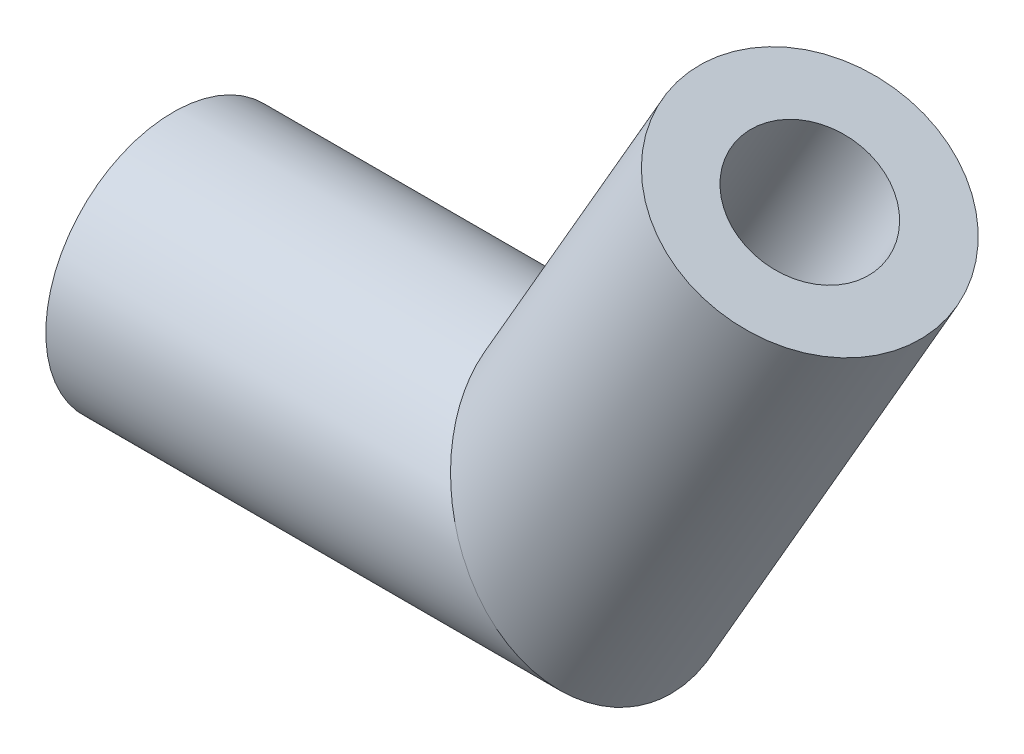
ISO-10303-21;
HEADER;
FILE_DESCRIPTION(('STEP AP214'),'2;1');
FILE_NAME('part.step','',(''),(''),'','','');
FILE_SCHEMA(('AUTOMOTIVE_DESIGN { 1 0 10303 214 1 1 1 1 }'));
ENDSEC;
DATA;
#1=APPLICATION_CONTEXT('core data for automotive mechanical design processes');
#2=APPLICATION_PROTOCOL_DEFINITION('international standard','automotive_design',2000,#1);
#3=PRODUCT_CONTEXT('',#1,'mechanical');
#4=PRODUCT('Part','Part','',(#3));
#5=PRODUCT_RELATED_PRODUCT_CATEGORY('part','',(#4));
#6=PRODUCT_DEFINITION_FORMATION('','',#4);
#7=PRODUCT_DEFINITION_CONTEXT('part definition',#1,'design');
#8=PRODUCT_DEFINITION('design','',#6,#7);
#9=PRODUCT_DEFINITION_SHAPE('','',#8);
#10=(LENGTH_UNIT() NAMED_UNIT(*) SI_UNIT(.MILLI.,.METRE.));
#11=(NAMED_UNIT(*) PLANE_ANGLE_UNIT() SI_UNIT($,.RADIAN.));
#12=(NAMED_UNIT(*) SI_UNIT($,.STERADIAN.) SOLID_ANGLE_UNIT());
#13=UNCERTAINTY_MEASURE_WITH_UNIT(LENGTH_MEASURE(1.E-05),#10,'distance_accuracy_value','');
#14=(GEOMETRIC_REPRESENTATION_CONTEXT(3) GLOBAL_UNCERTAINTY_ASSIGNED_CONTEXT((#13)) GLOBAL_UNIT_ASSIGNED_CONTEXT((#10,
#11,#12)) REPRESENTATION_CONTEXT('',''));
#15=CARTESIAN_POINT('',(0.,0.,0.));
#16=DIRECTION('',(0.,0.,1.));
#17=DIRECTION('',(1.,0.,0.));
#18=AXIS2_PLACEMENT_3D('',#15,#16,#17);
#19=CARTESIAN_POINT('',(8.04474411167424,-3.38660254037846,0.));
#20=DIRECTION('',(0.499999999999998,0.86602540378444,0.));
#21=DIRECTION('',(-0.86602540378444,0.499999999999998,0.));
#22=AXIS2_PLACEMENT_3D('',#19,#20,#21);
#23=CYLINDRICAL_SURFACE('',#22,3.);
#24=CARTESIAN_POINT('',(10.,0.,0.));
#25=DIRECTION('',(0.866025403784438,0.500000000000001,0.));
#26=DIRECTION('',(0.500000000000001,-0.866025403784438,0.));
#27=AXIS2_PLACEMENT_3D('',#24,#25,#26);
#28=ELLIPSE('',#27,3.46410161513776,3.);
#29=CARTESIAN_POINT('',(11.7320508075689,-3.,0.));
#30=VERTEX_POINT('',#29);
#31=EDGE_CURVE('E46',#30,#30,#28,.F.);
#32=ORIENTED_EDGE('',*,*,#31,.F.);
#33=EDGE_LOOP('',(#32));
#34=FACE_BOUND('',#33,.T.);
#35=CARTESIAN_POINT('',(15.,8.6602540378444,0.));
#36=DIRECTION('',(0.499999999999998,0.86602540378444,0.));
#37=DIRECTION('',(0.,0.,-1.));
#38=AXIS2_PLACEMENT_3D('',#35,#36,#37);
#39=CIRCLE('',#38,3.);
#40=CARTESIAN_POINT('',(15.,8.6602540378444,-3.));
#41=VERTEX_POINT('',#40);
#42=EDGE_CURVE('E66',#41,#41,#39,.T.);
#43=ORIENTED_EDGE('',*,*,#42,.F.);
#44=EDGE_LOOP('',(#43));
#45=FACE_BOUND('',#44,.T.);
#46=ADVANCED_FACE('F43',(#34,#45),#23,.T.);
#47=CARTESIAN_POINT('',(0.,0.,0.));
#48=DIRECTION('',(1.,0.,0.));
#49=DIRECTION('',(0.,0.,-1.));
#50=AXIS2_PLACEMENT_3D('',#47,#48,#49);
#51=CYLINDRICAL_SURFACE('',#50,3.);
#52=CARTESIAN_POINT('',(0.,0.,0.));
#53=DIRECTION('',(1.,0.,0.));
#54=DIRECTION('',(0.,0.,-1.));
#55=AXIS2_PLACEMENT_3D('',#52,#53,#54);
#56=CIRCLE('',#55,3.);
#57=CARTESIAN_POINT('',(0.,0.,-3.));
#58=VERTEX_POINT('',#57);
#59=EDGE_CURVE('E63',#58,#58,#56,.T.);
#60=ORIENTED_EDGE('',*,*,#59,.T.);
#61=EDGE_LOOP('',(#60));
#62=FACE_BOUND('',#61,.T.);
#63=ORIENTED_EDGE('',*,*,#31,.T.);
#64=EDGE_LOOP('',(#63));
#65=FACE_BOUND('',#64,.T.);
#66=ADVANCED_FACE('F75',(#62,#65),#51,.T.);
#67=CARTESIAN_POINT('',(15.,8.6602540378444,0.));
#68=DIRECTION('',(0.499999999999998,0.86602540378444,0.));
#69=DIRECTION('',(0.,0.,-1.));
#70=AXIS2_PLACEMENT_3D('',#67,#68,#69);
#71=PLANE('',#70);
#72=CARTESIAN_POINT('',(15.,8.6602540378444,0.));
#73=DIRECTION('',(0.499999999999998,0.86602540378444,0.));
#74=DIRECTION('',(0.,0.,-1.));
#75=AXIS2_PLACEMENT_3D('',#72,#73,#74);
#76=CIRCLE('',#75,1.6);
#77=CARTESIAN_POINT('',(15.,8.6602540378444,-1.6));
#78=VERTEX_POINT('',#77);
#79=EDGE_CURVE('E57',#78,#78,#76,.F.);
#80=ORIENTED_EDGE('',*,*,#79,.T.);
#81=EDGE_LOOP('',(#80));
#82=FACE_BOUND('',#81,.T.);
#83=ORIENTED_EDGE('',*,*,#42,.T.);
#84=EDGE_LOOP('',(#83));
#85=FACE_BOUND('',#84,.T.);
#86=ADVANCED_FACE('F82',(#82,#85),#71,.T.);
#87=CARTESIAN_POINT('',(0.,0.,0.));
#88=DIRECTION('',(1.,0.,0.));
#89=DIRECTION('',(0.,0.,-1.));
#90=AXIS2_PLACEMENT_3D('',#87,#88,#89);
#91=PLANE('',#90);
#92=CARTESIAN_POINT('',(0.,0.,0.));
#93=DIRECTION('',(1.,0.,0.));
#94=DIRECTION('',(0.,0.,-1.));
#95=AXIS2_PLACEMENT_3D('',#92,#93,#94);
#96=CIRCLE('',#95,1.6);
#97=CARTESIAN_POINT('',(0.,0.,-1.6));
#98=VERTEX_POINT('',#97);
#99=EDGE_CURVE('E51',#98,#98,#96,.F.);
#100=ORIENTED_EDGE('',*,*,#99,.F.);
#101=EDGE_LOOP('',(#100));
#102=FACE_BOUND('',#101,.T.);
#103=ORIENTED_EDGE('',*,*,#59,.F.);
#104=EDGE_LOOP('',(#103));
#105=FACE_BOUND('',#104,.T.);
#106=ADVANCED_FACE('F92',(#102,#105),#91,.F.);
#107=CARTESIAN_POINT('',(8.93386352622626,-1.84660254037845,0.));
#108=DIRECTION('',(0.499999999999998,0.86602540378444,0.));
#109=DIRECTION('',(-0.86602540378444,0.499999999999998,0.));
#110=AXIS2_PLACEMENT_3D('',#107,#108,#109);
#111=CYLINDRICAL_SURFACE('',#110,1.6);
#112=CARTESIAN_POINT('',(10.,0.,0.));
#113=DIRECTION('',(0.866025403784438,0.500000000000001,0.));
#114=DIRECTION('',(0.500000000000001,-0.866025403784438,0.));
#115=AXIS2_PLACEMENT_3D('',#112,#113,#114);
#116=ELLIPSE('',#115,1.8475208614068,1.6);
#117=CARTESIAN_POINT('',(10.9237604307034,-1.6,0.));
#118=VERTEX_POINT('',#117);
#119=EDGE_CURVE('E10',#118,#118,#116,.T.);
#120=ORIENTED_EDGE('',*,*,#119,.F.);
#121=EDGE_LOOP('',(#120));
#122=FACE_BOUND('',#121,.T.);
#123=ORIENTED_EDGE('',*,*,#79,.F.);
#124=EDGE_LOOP('',(#123));
#125=FACE_BOUND('',#124,.T.);
#126=ADVANCED_FACE('F86',(#122,#125),#111,.F.);
#127=CARTESIAN_POINT('',(0.,0.,0.));
#128=DIRECTION('',(1.,0.,0.));
#129=DIRECTION('',(0.,0.,-1.));
#130=AXIS2_PLACEMENT_3D('',#127,#128,#129);
#131=CYLINDRICAL_SURFACE('',#130,1.6);
#132=ORIENTED_EDGE('',*,*,#99,.T.);
#133=EDGE_LOOP('',(#132));
#134=FACE_BOUND('',#133,.T.);
#135=ORIENTED_EDGE('',*,*,#119,.T.);
#136=EDGE_LOOP('',(#135));
#137=FACE_BOUND('',#136,.T.);
#138=ADVANCED_FACE('F84',(#134,#137),#131,.F.);
#139=CLOSED_SHELL('',(#46,#66,#86,#106,#126,#138));
#140=MANIFOLD_SOLID_BREP('B2',#139);
#141=ADVANCED_BREP_SHAPE_REPRESENTATION('',(#18,#140),#14);
#142=SHAPE_DEFINITION_REPRESENTATION(#9,#141);
ENDSEC;
END-ISO-10303-21;
